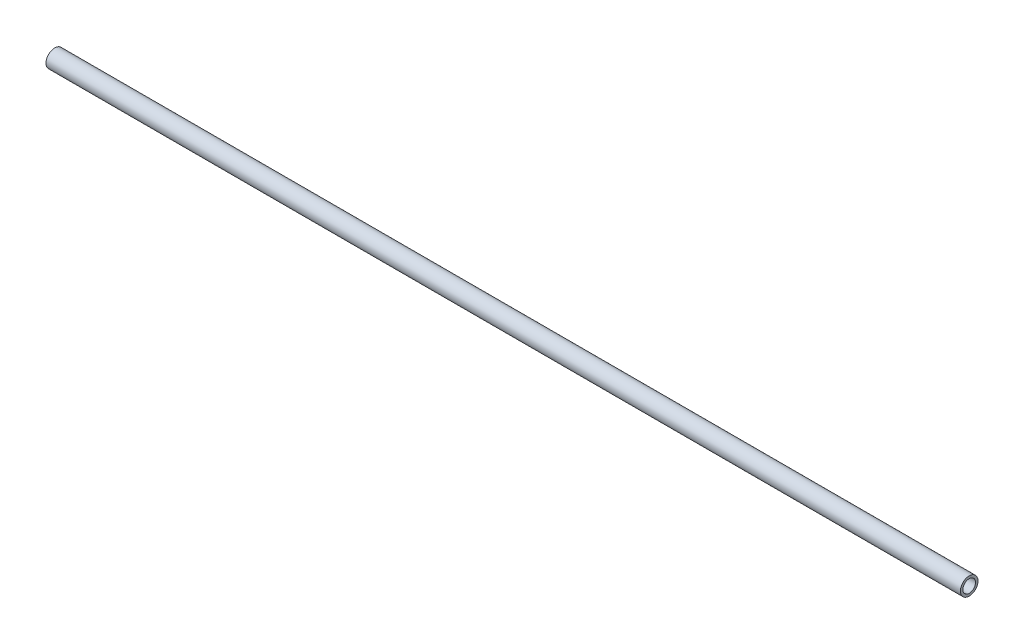
ISO-10303-21;
HEADER;
FILE_DESCRIPTION(('STEP AP214'),'2;1');
FILE_NAME('part.step','',(''),(''),'','','');
FILE_SCHEMA(('AUTOMOTIVE_DESIGN { 1 0 10303 214 1 1 1 1 }'));
ENDSEC;
DATA;
#1=APPLICATION_CONTEXT('core data for automotive mechanical design processes');
#2=APPLICATION_PROTOCOL_DEFINITION('international standard','automotive_design',2000,#1);
#3=PRODUCT_CONTEXT('',#1,'mechanical');
#4=PRODUCT('Part','Part','',(#3));
#5=PRODUCT_RELATED_PRODUCT_CATEGORY('part','',(#4));
#6=PRODUCT_DEFINITION_FORMATION('','',#4);
#7=PRODUCT_DEFINITION_CONTEXT('part definition',#1,'design');
#8=PRODUCT_DEFINITION('design','',#6,#7);
#9=PRODUCT_DEFINITION_SHAPE('','',#8);
#10=(LENGTH_UNIT() NAMED_UNIT(*) SI_UNIT(.MILLI.,.METRE.));
#11=(NAMED_UNIT(*) PLANE_ANGLE_UNIT() SI_UNIT($,.RADIAN.));
#12=(NAMED_UNIT(*) SI_UNIT($,.STERADIAN.) SOLID_ANGLE_UNIT());
#13=UNCERTAINTY_MEASURE_WITH_UNIT(LENGTH_MEASURE(1.E-05),#10,'distance_accuracy_value','');
#14=(GEOMETRIC_REPRESENTATION_CONTEXT(3) GLOBAL_UNCERTAINTY_ASSIGNED_CONTEXT((#13)) GLOBAL_UNIT_ASSIGNED_CONTEXT((#10,
#11,#12)) REPRESENTATION_CONTEXT('',''));
#15=CARTESIAN_POINT('',(0.,0.,0.));
#16=DIRECTION('',(0.,0.,1.));
#17=DIRECTION('',(1.,0.,0.));
#18=AXIS2_PLACEMENT_3D('',#15,#16,#17);
#19=CARTESIAN_POINT('',(228.5873,17.5276821192053,0.));
#20=DIRECTION('',(1.,0.,0.));
#21=DIRECTION('',(0.,0.,-1.));
#22=AXIS2_PLACEMENT_3D('',#19,#20,#21);
#23=PLANE('',#22);
#24=CARTESIAN_POINT('',(228.5873,17.5276821192053,0.));
#25=DIRECTION('',(1.,0.,0.));
#26=DIRECTION('',(0.,0.,-1.));
#27=AXIS2_PLACEMENT_3D('',#24,#25,#26);
#28=CIRCLE('',#27,3.175);
#29=CARTESIAN_POINT('',(228.5873,17.5276821192053,-3.175));
#30=VERTEX_POINT('',#29);
#31=EDGE_CURVE('E10',#30,#30,#28,.T.);
#32=ORIENTED_EDGE('',*,*,#31,.T.);
#33=EDGE_LOOP('',(#32));
#34=FACE_BOUND('',#33,.T.);
#35=CARTESIAN_POINT('',(228.5873,17.5276821192053,0.));
#36=DIRECTION('',(1.,0.,0.));
#37=DIRECTION('',(0.,0.,-1.));
#38=AXIS2_PLACEMENT_3D('',#35,#36,#37);
#39=CIRCLE('',#38,2.286);
#40=CARTESIAN_POINT('',(228.5873,17.5276821192053,-2.286));
#41=VERTEX_POINT('',#40);
#42=EDGE_CURVE('E44',#41,#41,#39,.T.);
#43=ORIENTED_EDGE('',*,*,#42,.F.);
#44=EDGE_LOOP('',(#43));
#45=FACE_BOUND('',#44,.T.);
#46=ADVANCED_FACE('F33',(#34,#45),#23,.T.);
#47=CARTESIAN_POINT('',(-101.5873,17.5276821192053,0.));
#48=DIRECTION('',(1.,0.,0.));
#49=DIRECTION('',(0.,0.,-1.));
#50=AXIS2_PLACEMENT_3D('',#47,#48,#49);
#51=PLANE('',#50);
#52=CARTESIAN_POINT('',(-101.5873,17.5276821192053,0.));
#53=DIRECTION('',(1.,0.,0.));
#54=DIRECTION('',(0.,0.,-1.));
#55=AXIS2_PLACEMENT_3D('',#52,#53,#54);
#56=CIRCLE('',#55,3.175);
#57=CARTESIAN_POINT('',(-101.5873,17.5276821192053,-3.175));
#58=VERTEX_POINT('',#57);
#59=EDGE_CURVE('E37',#58,#58,#56,.T.);
#60=ORIENTED_EDGE('',*,*,#59,.F.);
#61=EDGE_LOOP('',(#60));
#62=FACE_BOUND('',#61,.T.);
#63=CARTESIAN_POINT('',(-101.5873,17.5276821192053,0.));
#64=DIRECTION('',(1.,0.,0.));
#65=DIRECTION('',(0.,0.,-1.));
#66=AXIS2_PLACEMENT_3D('',#63,#64,#65);
#67=CIRCLE('',#66,2.286);
#68=CARTESIAN_POINT('',(-101.5873,17.5276821192053,-2.286));
#69=VERTEX_POINT('',#68);
#70=EDGE_CURVE('E46',#69,#69,#67,.T.);
#71=ORIENTED_EDGE('',*,*,#70,.T.);
#72=EDGE_LOOP('',(#71));
#73=FACE_BOUND('',#72,.T.);
#74=ADVANCED_FACE('F56',(#62,#73),#51,.F.);
#75=CARTESIAN_POINT('',(228.5873,17.5276821192053,0.));
#76=DIRECTION('',(-1.,0.,0.));
#77=DIRECTION('',(0.,0.,1.));
#78=AXIS2_PLACEMENT_3D('',#75,#76,#77);
#79=CYLINDRICAL_SURFACE('',#78,3.175);
#80=ORIENTED_EDGE('',*,*,#31,.F.);
#81=EDGE_LOOP('',(#80));
#82=FACE_BOUND('',#81,.T.);
#83=ORIENTED_EDGE('',*,*,#59,.T.);
#84=EDGE_LOOP('',(#83));
#85=FACE_BOUND('',#84,.T.);
#86=ADVANCED_FACE('F35',(#82,#85),#79,.T.);
#87=CARTESIAN_POINT('',(228.5873,17.5276821192053,0.));
#88=DIRECTION('',(-1.,0.,0.));
#89=DIRECTION('',(0.,0.,1.));
#90=AXIS2_PLACEMENT_3D('',#87,#88,#89);
#91=CYLINDRICAL_SURFACE('',#90,2.286);
#92=ORIENTED_EDGE('',*,*,#42,.T.);
#93=EDGE_LOOP('',(#92));
#94=FACE_BOUND('',#93,.T.);
#95=ORIENTED_EDGE('',*,*,#70,.F.);
#96=EDGE_LOOP('',(#95));
#97=FACE_BOUND('',#96,.T.);
#98=ADVANCED_FACE('F52',(#94,#97),#91,.F.);
#99=CLOSED_SHELL('',(#46,#74,#86,#98));
#100=MANIFOLD_SOLID_BREP('B2',#99);
#101=ADVANCED_BREP_SHAPE_REPRESENTATION('',(#18,#100),#14);
#102=SHAPE_DEFINITION_REPRESENTATION(#9,#101);
ENDSEC;
END-ISO-10303-21;
